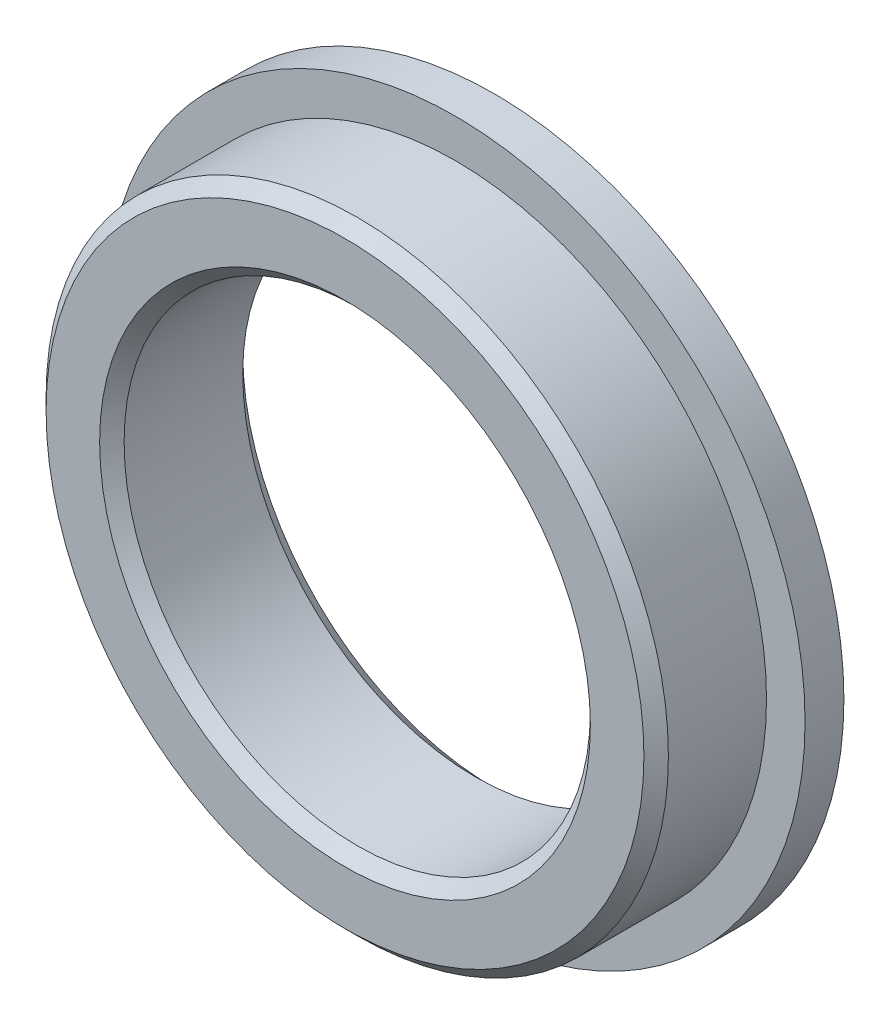
ISO-10303-21;
HEADER;
FILE_DESCRIPTION(('STEP AP214'),'2;1');
FILE_NAME('part.step','',(''),(''),'','','');
FILE_SCHEMA(('AUTOMOTIVE_DESIGN { 1 0 10303 214 1 1 1 1 }'));
ENDSEC;
DATA;
#1=APPLICATION_CONTEXT('core data for automotive mechanical design processes');
#2=APPLICATION_PROTOCOL_DEFINITION('international standard','automotive_design',2000,#1);
#3=PRODUCT_CONTEXT('',#1,'mechanical');
#4=PRODUCT('Part','Part','',(#3));
#5=PRODUCT_RELATED_PRODUCT_CATEGORY('part','',(#4));
#6=PRODUCT_DEFINITION_FORMATION('','',#4);
#7=PRODUCT_DEFINITION_CONTEXT('part definition',#1,'design');
#8=PRODUCT_DEFINITION('design','',#6,#7);
#9=PRODUCT_DEFINITION_SHAPE('','',#8);
#10=(LENGTH_UNIT() NAMED_UNIT(*) SI_UNIT(.MILLI.,.METRE.));
#11=(NAMED_UNIT(*) PLANE_ANGLE_UNIT() SI_UNIT($,.RADIAN.));
#12=(NAMED_UNIT(*) SI_UNIT($,.STERADIAN.) SOLID_ANGLE_UNIT());
#13=UNCERTAINTY_MEASURE_WITH_UNIT(LENGTH_MEASURE(1.E-05),#10,'distance_accuracy_value','');
#14=(GEOMETRIC_REPRESENTATION_CONTEXT(3) GLOBAL_UNCERTAINTY_ASSIGNED_CONTEXT((#13)) GLOBAL_UNIT_ASSIGNED_CONTEXT((#10,
#11,#12)) REPRESENTATION_CONTEXT('',''));
#15=CARTESIAN_POINT('',(0.,0.,0.));
#16=DIRECTION('',(0.,0.,1.));
#17=DIRECTION('',(1.,0.,0.));
#18=AXIS2_PLACEMENT_3D('',#15,#16,#17);
#19=CARTESIAN_POINT('',(0.,9.525,3.048));
#20=DIRECTION('',(0.,0.,-1.));
#21=DIRECTION('',(-1.,0.,0.));
#22=AXIS2_PLACEMENT_3D('',#19,#20,#21);
#23=PLANE('',#22);
#24=CARTESIAN_POINT('',(0.,0.,3.048));
#25=DIRECTION('',(0.,0.,-1.));
#26=DIRECTION('',(-1.,0.,0.));
#27=AXIS2_PLACEMENT_3D('',#24,#25,#26);
#28=CIRCLE('',#27,12.2127);
#29=CARTESIAN_POINT('',(-12.2127,0.,3.048));
#30=VERTEX_POINT('',#29);
#31=EDGE_CURVE('E18',#30,#30,#28,.T.);
#32=ORIENTED_EDGE('',*,*,#31,.F.);
#33=EDGE_LOOP('',(#32));
#34=FACE_BOUND('',#33,.T.);
#35=CARTESIAN_POINT('',(0.,0.,3.048));
#36=DIRECTION('',(0.,0.,1.));
#37=DIRECTION('',(1.,0.,0.));
#38=AXIS2_PLACEMENT_3D('',#35,#36,#37);
#39=CIRCLE('',#38,10.025);
#40=CARTESIAN_POINT('',(10.025,0.,3.048));
#41=VERTEX_POINT('',#40);
#42=EDGE_CURVE('E39',#41,#41,#39,.F.);
#43=ORIENTED_EDGE('',*,*,#42,.T.);
#44=EDGE_LOOP('',(#43));
#45=FACE_BOUND('',#44,.T.);
#46=ADVANCED_FACE('F15',(#34,#45),#23,.F.);
#47=CARTESIAN_POINT('',(0.,0.,2.548));
#48=DIRECTION('',(0.,0.,-1.));
#49=DIRECTION('',(-1.,0.,0.));
#50=AXIS2_PLACEMENT_3D('',#47,#48,#49);
#51=CONICAL_SURFACE('',#50,12.7127,0.785398163397447);
#52=CARTESIAN_POINT('',(0.,0.,2.548));
#53=DIRECTION('',(0.,0.,1.));
#54=DIRECTION('',(1.,0.,0.));
#55=AXIS2_PLACEMENT_3D('',#52,#53,#54);
#56=CIRCLE('',#55,12.7127);
#57=CARTESIAN_POINT('',(12.7127,0.,2.548));
#58=VERTEX_POINT('',#57);
#59=EDGE_CURVE('E30',#58,#58,#56,.F.);
#60=ORIENTED_EDGE('',*,*,#59,.F.);
#61=EDGE_LOOP('',(#60));
#62=FACE_BOUND('',#61,.T.);
#63=ORIENTED_EDGE('',*,*,#31,.T.);
#64=EDGE_LOOP('',(#63));
#65=FACE_BOUND('',#64,.T.);
#66=ADVANCED_FACE('F47',(#62,#65),#51,.T.);
#67=CARTESIAN_POINT('',(0.,0.,3.048));
#68=DIRECTION('',(0.,0.,1.));
#69=DIRECTION('',(1.,0.,0.));
#70=AXIS2_PLACEMENT_3D('',#67,#68,#69);
#71=CONICAL_SURFACE('',#70,10.025,0.785398163397446);
#72=ORIENTED_EDGE('',*,*,#42,.F.);
#73=EDGE_LOOP('',(#72));
#74=FACE_BOUND('',#73,.T.);
#75=CARTESIAN_POINT('',(0.,0.,2.54799999999999));
#76=DIRECTION('',(0.,0.,1.));
#77=DIRECTION('',(1.,0.,0.));
#78=AXIS2_PLACEMENT_3D('',#75,#76,#77);
#79=CIRCLE('',#78,9.525);
#80=CARTESIAN_POINT('',(9.525,0.,2.54799999999999));
#81=VERTEX_POINT('',#80);
#82=EDGE_CURVE('E38',#81,#81,#79,.F.);
#83=ORIENTED_EDGE('',*,*,#82,.T.);
#84=EDGE_LOOP('',(#83));
#85=FACE_BOUND('',#84,.T.);
#86=ADVANCED_FACE('F53',(#74,#85),#71,.F.);
#87=CARTESIAN_POINT('',(0.,0.,4.09575));
#88=DIRECTION('',(0.,0.,1.));
#89=DIRECTION('',(1.,0.,0.));
#90=AXIS2_PLACEMENT_3D('',#87,#88,#89);
#91=CYLINDRICAL_SURFACE('',#90,12.7127);
#92=ORIENTED_EDGE('',*,*,#59,.T.);
#93=EDGE_LOOP('',(#92));
#94=FACE_BOUND('',#93,.T.);
#95=CARTESIAN_POINT('',(0.,0.,-1.4605));
#96=DIRECTION('',(0.,0.,1.));
#97=DIRECTION('',(1.,0.,0.));
#98=AXIS2_PLACEMENT_3D('',#95,#96,#97);
#99=CIRCLE('',#98,12.7127);
#100=CARTESIAN_POINT('',(12.7127,0.,-1.4605));
#101=VERTEX_POINT('',#100);
#102=EDGE_CURVE('E36',#101,#101,#99,.T.);
#103=ORIENTED_EDGE('',*,*,#102,.T.);
#104=EDGE_LOOP('',(#103));
#105=FACE_BOUND('',#104,.T.);
#106=ADVANCED_FACE('F78',(#94,#105),#91,.T.);
#107=CARTESIAN_POINT('',(0.,0.,4.09575));
#108=DIRECTION('',(0.,0.,1.));
#109=DIRECTION('',(1.,0.,0.));
#110=AXIS2_PLACEMENT_3D('',#107,#108,#109);
#111=CYLINDRICAL_SURFACE('',#110,9.525);
#112=ORIENTED_EDGE('',*,*,#82,.F.);
#113=EDGE_LOOP('',(#112));
#114=FACE_BOUND('',#113,.T.);
#115=CARTESIAN_POINT('',(0.,0.,-2.298));
#116=DIRECTION('',(0.,0.,-1.));
#117=DIRECTION('',(-1.,0.,0.));
#118=AXIS2_PLACEMENT_3D('',#115,#116,#117);
#119=CIRCLE('',#118,9.525);
#120=CARTESIAN_POINT('',(-9.525,0.,-2.298));
#121=VERTEX_POINT('',#120);
#122=EDGE_CURVE('E35',#121,#121,#119,.T.);
#123=ORIENTED_EDGE('',*,*,#122,.T.);
#124=EDGE_LOOP('',(#123));
#125=FACE_BOUND('',#124,.T.);
#126=ADVANCED_FACE('F74',(#114,#125),#111,.F.);
#127=CARTESIAN_POINT('',(0.,12.7127,-1.4605));
#128=DIRECTION('',(0.,0.,-1.));
#129=DIRECTION('',(-1.,0.,0.));
#130=AXIS2_PLACEMENT_3D('',#127,#128,#129);
#131=PLANE('',#130);
#132=CARTESIAN_POINT('',(0.,0.,-1.4605));
#133=DIRECTION('',(0.,0.,1.));
#134=DIRECTION('',(1.,0.,0.));
#135=AXIS2_PLACEMENT_3D('',#132,#133,#134);
#136=CIRCLE('',#135,14.2875);
#137=CARTESIAN_POINT('',(14.2875,0.,-1.4605));
#138=VERTEX_POINT('',#137);
#139=EDGE_CURVE('E27',#138,#138,#136,.F.);
#140=ORIENTED_EDGE('',*,*,#139,.F.);
#141=EDGE_LOOP('',(#140));
#142=FACE_BOUND('',#141,.T.);
#143=ORIENTED_EDGE('',*,*,#102,.F.);
#144=EDGE_LOOP('',(#143));
#145=FACE_BOUND('',#144,.T.);
#146=ADVANCED_FACE('F70',(#142,#145),#131,.F.);
#147=CARTESIAN_POINT('',(0.,0.,-3.048));
#148=DIRECTION('',(0.,0.,-1.));
#149=DIRECTION('',(-1.,0.,0.));
#150=AXIS2_PLACEMENT_3D('',#147,#148,#149);
#151=CONICAL_SURFACE('',#150,10.275,0.785398163397446);
#152=CARTESIAN_POINT('',(0.,0.,-3.048));
#153=DIRECTION('',(0.,0.,-1.));
#154=DIRECTION('',(-1.,0.,0.));
#155=AXIS2_PLACEMENT_3D('',#152,#153,#154);
#156=CIRCLE('',#155,10.275);
#157=CARTESIAN_POINT('',(-10.275,0.,-3.048));
#158=VERTEX_POINT('',#157);
#159=EDGE_CURVE('E22',#158,#158,#156,.T.);
#160=ORIENTED_EDGE('',*,*,#159,.T.);
#161=EDGE_LOOP('',(#160));
#162=FACE_BOUND('',#161,.T.);
#163=ORIENTED_EDGE('',*,*,#122,.F.);
#164=EDGE_LOOP('',(#163));
#165=FACE_BOUND('',#164,.T.);
#166=ADVANCED_FACE('F63',(#162,#165),#151,.F.);
#167=CARTESIAN_POINT('',(0.,0.,4.09575));
#168=DIRECTION('',(0.,0.,1.));
#169=DIRECTION('',(1.,0.,0.));
#170=AXIS2_PLACEMENT_3D('',#167,#168,#169);
#171=CYLINDRICAL_SURFACE('',#170,14.2875);
#172=ORIENTED_EDGE('',*,*,#139,.T.);
#173=EDGE_LOOP('',(#172));
#174=FACE_BOUND('',#173,.T.);
#175=CARTESIAN_POINT('',(0.,0.,-3.048));
#176=DIRECTION('',(0.,0.,1.));
#177=DIRECTION('',(1.,0.,0.));
#178=AXIS2_PLACEMENT_3D('',#175,#176,#177);
#179=CIRCLE('',#178,14.2875);
#180=CARTESIAN_POINT('',(14.2875,0.,-3.048));
#181=VERTEX_POINT('',#180);
#182=EDGE_CURVE('E9',#181,#181,#179,.T.);
#183=ORIENTED_EDGE('',*,*,#182,.T.);
#184=EDGE_LOOP('',(#183));
#185=FACE_BOUND('',#184,.T.);
#186=ADVANCED_FACE('F57',(#174,#185),#171,.T.);
#187=CARTESIAN_POINT('',(0.,14.2875,-3.048));
#188=DIRECTION('',(0.,0.,1.));
#189=DIRECTION('',(1.,0.,0.));
#190=AXIS2_PLACEMENT_3D('',#187,#188,#189);
#191=PLANE('',#190);
#192=ORIENTED_EDGE('',*,*,#182,.F.);
#193=EDGE_LOOP('',(#192));
#194=FACE_BOUND('',#193,.T.);
#195=ORIENTED_EDGE('',*,*,#159,.F.);
#196=EDGE_LOOP('',(#195));
#197=FACE_BOUND('',#196,.T.);
#198=ADVANCED_FACE('F55',(#194,#197),#191,.F.);
#199=CLOSED_SHELL('',(#46,#66,#86,#106,#126,#146,#166,#186,#198));
#200=MANIFOLD_SOLID_BREP('B1',#199);
#201=ADVANCED_BREP_SHAPE_REPRESENTATION('',(#18,#200),#14);
#202=SHAPE_DEFINITION_REPRESENTATION(#9,#201);
ENDSEC;
END-ISO-10303-21;
